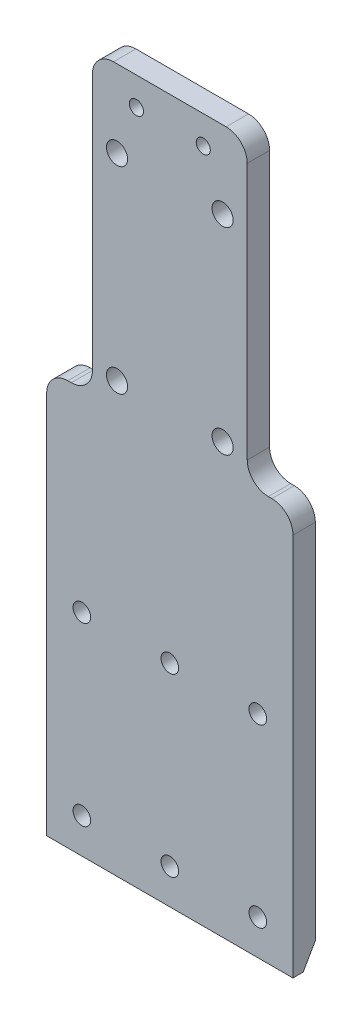
ISO-10303-21;
HEADER;
FILE_DESCRIPTION(('STEP AP214'),'2;1');
FILE_NAME('part.step','',(''),(''),'','','');
FILE_SCHEMA(('AUTOMOTIVE_DESIGN { 1 0 10303 214 1 1 1 1 }'));
ENDSEC;
DATA;
#1=APPLICATION_CONTEXT('core data for automotive mechanical design processes');
#2=APPLICATION_PROTOCOL_DEFINITION('international standard','automotive_design',2000,#1);
#3=PRODUCT_CONTEXT('',#1,'mechanical');
#4=PRODUCT('Part','Part','',(#3));
#5=PRODUCT_RELATED_PRODUCT_CATEGORY('part','',(#4));
#6=PRODUCT_DEFINITION_FORMATION('','',#4);
#7=PRODUCT_DEFINITION_CONTEXT('part definition',#1,'design');
#8=PRODUCT_DEFINITION('design','',#6,#7);
#9=PRODUCT_DEFINITION_SHAPE('','',#8);
#10=(LENGTH_UNIT() NAMED_UNIT(*) SI_UNIT(.MILLI.,.METRE.));
#11=(NAMED_UNIT(*) PLANE_ANGLE_UNIT() SI_UNIT($,.RADIAN.));
#12=(NAMED_UNIT(*) SI_UNIT($,.STERADIAN.) SOLID_ANGLE_UNIT());
#13=UNCERTAINTY_MEASURE_WITH_UNIT(LENGTH_MEASURE(1.E-05),#10,'distance_accuracy_value','');
#14=(GEOMETRIC_REPRESENTATION_CONTEXT(3) GLOBAL_UNCERTAINTY_ASSIGNED_CONTEXT((#13)) GLOBAL_UNIT_ASSIGNED_CONTEXT((#10,
#11,#12)) REPRESENTATION_CONTEXT('',''));
#15=CARTESIAN_POINT('',(0.,0.,0.));
#16=DIRECTION('',(0.,0.,1.));
#17=DIRECTION('',(1.,0.,0.));
#18=AXIS2_PLACEMENT_3D('',#15,#16,#17);
#19=CARTESIAN_POINT('',(-17.5,50.,3.175));
#20=DIRECTION('',(1.,0.,0.));
#21=DIRECTION('',(0.,1.,0.));
#22=AXIS2_PLACEMENT_3D('',#19,#20,#21);
#23=PLANE('',#22);
#24=DIRECTION('',(0.,-1.,0.));
#25=VECTOR('',#24,1.);
#26=CARTESIAN_POINT('',(-17.5,50.,0.));
#27=LINE('',#26,#25);
#28=CARTESIAN_POINT('',(-17.5,4.5,0.));
#29=VERTEX_POINT('',#28);
#30=CARTESIAN_POINT('',(-17.5,-47.,0.));
#31=VERTEX_POINT('',#30);
#32=EDGE_CURVE('E230',#29,#31,#27,.T.);
#33=ORIENTED_EDGE('',*,*,#32,.T.);
#34=DIRECTION('',(0.,0.86602540378444,-0.499999999999998));
#35=VECTOR('',#34,1.);
#36=CARTESIAN_POINT('',(-17.5,-50.,1.73205080756888));
#37=LINE('',#36,#35);
#38=CARTESIAN_POINT('',(-17.5,-50.,1.73205080756888));
#39=VERTEX_POINT('',#38);
#40=EDGE_CURVE('E11',#31,#39,#37,.F.);
#41=ORIENTED_EDGE('',*,*,#40,.T.);
#42=DIRECTION('',(0.,0.,-1.));
#43=VECTOR('',#42,1.);
#44=CARTESIAN_POINT('',(-17.5,-50.,3.175));
#45=LINE('',#44,#43);
#46=CARTESIAN_POINT('',(-17.5,-50.,3.175));
#47=VERTEX_POINT('',#46);
#48=EDGE_CURVE('E156',#47,#39,#45,.T.);
#49=ORIENTED_EDGE('',*,*,#48,.F.);
#50=DIRECTION('',(0.,-1.,0.));
#51=VECTOR('',#50,1.);
#52=CARTESIAN_POINT('',(-17.5,50.,3.175));
#53=LINE('',#52,#51);
#54=CARTESIAN_POINT('',(-17.5,4.5,3.175));
#55=VERTEX_POINT('',#54);
#56=EDGE_CURVE('E138',#55,#47,#53,.T.);
#57=ORIENTED_EDGE('',*,*,#56,.F.);
#58=DIRECTION('',(0.,0.,1.));
#59=VECTOR('',#58,1.);
#60=CARTESIAN_POINT('',(-17.5,4.5,3.175));
#61=LINE('',#60,#59);
#62=EDGE_CURVE('E204',#55,#29,#61,.F.);
#63=ORIENTED_EDGE('',*,*,#62,.T.);
#64=EDGE_LOOP('',(#33,#41,#49,#57,#63));
#65=FACE_BOUND('',#64,.T.);
#66=ADVANCED_FACE('F33',(#65),#23,.F.);
#67=CARTESIAN_POINT('',(-17.5,-50.,3.175));
#68=DIRECTION('',(0.,1.,0.));
#69=DIRECTION('',(0.,0.,1.));
#70=AXIS2_PLACEMENT_3D('',#67,#68,#69);
#71=PLANE('',#70);
#72=ORIENTED_EDGE('',*,*,#48,.T.);
#73=DIRECTION('',(1.,0.,0.));
#74=VECTOR('',#73,1.);
#75=CARTESIAN_POINT('',(-17.5,-50.,1.73205080756888));
#76=LINE('',#75,#74);
#77=CARTESIAN_POINT('',(17.5,-50.,1.73205080756888));
#78=VERTEX_POINT('',#77);
#79=EDGE_CURVE('E222',#39,#78,#76,.T.);
#80=ORIENTED_EDGE('',*,*,#79,.T.);
#81=DIRECTION('',(0.,0.,-1.));
#82=VECTOR('',#81,1.);
#83=CARTESIAN_POINT('',(17.5,-50.,3.175));
#84=LINE('',#83,#82);
#85=CARTESIAN_POINT('',(17.5,-50.,3.175));
#86=VERTEX_POINT('',#85);
#87=EDGE_CURVE('E158',#86,#78,#84,.T.);
#88=ORIENTED_EDGE('',*,*,#87,.F.);
#89=DIRECTION('',(1.,0.,0.));
#90=VECTOR('',#89,1.);
#91=CARTESIAN_POINT('',(-17.5,-50.,3.175));
#92=LINE('',#91,#90);
#93=EDGE_CURVE('E143',#47,#86,#92,.T.);
#94=ORIENTED_EDGE('',*,*,#93,.F.);
#95=EDGE_LOOP('',(#72,#80,#88,#94));
#96=FACE_BOUND('',#95,.T.);
#97=ADVANCED_FACE('F154',(#96),#71,.F.);
#98=CARTESIAN_POINT('',(17.5,50.,3.175));
#99=DIRECTION('',(-1.,0.,0.));
#100=DIRECTION('',(0.,-1.,0.));
#101=AXIS2_PLACEMENT_3D('',#98,#99,#100);
#102=PLANE('',#101);
#103=ORIENTED_EDGE('',*,*,#87,.T.);
#104=DIRECTION('',(0.,-0.86602540378444,0.499999999999998));
#105=VECTOR('',#104,1.);
#106=CARTESIAN_POINT('',(17.5,-50.,1.73205080756888));
#107=LINE('',#106,#105);
#108=CARTESIAN_POINT('',(17.5,-47.,0.));
#109=VERTEX_POINT('',#108);
#110=EDGE_CURVE('E55',#78,#109,#107,.F.);
#111=ORIENTED_EDGE('',*,*,#110,.T.);
#112=DIRECTION('',(0.,1.,0.));
#113=VECTOR('',#112,1.);
#114=CARTESIAN_POINT('',(17.5,50.,0.));
#115=LINE('',#114,#113);
#116=CARTESIAN_POINT('',(17.5,4.5,0.));
#117=VERTEX_POINT('',#116);
#118=EDGE_CURVE('E232',#109,#117,#115,.T.);
#119=ORIENTED_EDGE('',*,*,#118,.T.);
#120=DIRECTION('',(0.,0.,1.));
#121=VECTOR('',#120,1.);
#122=CARTESIAN_POINT('',(17.5,4.5,3.175));
#123=LINE('',#122,#121);
#124=CARTESIAN_POINT('',(17.5,4.5,3.175));
#125=VERTEX_POINT('',#124);
#126=EDGE_CURVE('E206',#117,#125,#123,.T.);
#127=ORIENTED_EDGE('',*,*,#126,.T.);
#128=DIRECTION('',(0.,1.,0.));
#129=VECTOR('',#128,1.);
#130=CARTESIAN_POINT('',(17.5,50.,3.175));
#131=LINE('',#130,#129);
#132=EDGE_CURVE('E160',#86,#125,#131,.T.);
#133=ORIENTED_EDGE('',*,*,#132,.F.);
#134=EDGE_LOOP('',(#103,#111,#119,#127,#133));
#135=FACE_BOUND('',#134,.T.);
#136=ADVANCED_FACE('F225',(#135),#102,.F.);
#137=CARTESIAN_POINT('',(-17.5,50.,3.175));
#138=DIRECTION('',(0.,-1.,0.));
#139=DIRECTION('',(0.,0.,-1.));
#140=AXIS2_PLACEMENT_3D('',#137,#138,#139);
#141=PLANE('',#140);
#142=DIRECTION('',(-1.,0.,0.));
#143=VECTOR('',#142,1.);
#144=CARTESIAN_POINT('',(-17.5,50.,0.));
#145=LINE('',#144,#143);
#146=CARTESIAN_POINT('',(8.,50.,0.));
#147=VERTEX_POINT('',#146);
#148=CARTESIAN_POINT('',(-8.,50.,0.));
#149=VERTEX_POINT('',#148);
#150=EDGE_CURVE('E150',#147,#149,#145,.T.);
#151=ORIENTED_EDGE('',*,*,#150,.T.);
#152=DIRECTION('',(0.,0.,1.));
#153=VECTOR('',#152,1.);
#154=CARTESIAN_POINT('',(-8.,50.,3.175));
#155=LINE('',#154,#153);
#156=CARTESIAN_POINT('',(-8.,50.,3.175));
#157=VERTEX_POINT('',#156);
#158=EDGE_CURVE('E165',#149,#157,#155,.T.);
#159=ORIENTED_EDGE('',*,*,#158,.T.);
#160=DIRECTION('',(-1.,0.,0.));
#161=VECTOR('',#160,1.);
#162=CARTESIAN_POINT('',(-17.5,50.,3.175));
#163=LINE('',#162,#161);
#164=CARTESIAN_POINT('',(8.,50.,3.175));
#165=VERTEX_POINT('',#164);
#166=EDGE_CURVE('E167',#165,#157,#163,.T.);
#167=ORIENTED_EDGE('',*,*,#166,.F.);
#168=DIRECTION('',(0.,0.,1.));
#169=VECTOR('',#168,1.);
#170=CARTESIAN_POINT('',(8.,50.,3.175));
#171=LINE('',#170,#169);
#172=EDGE_CURVE('E163',#165,#147,#171,.F.);
#173=ORIENTED_EDGE('',*,*,#172,.T.);
#174=EDGE_LOOP('',(#151,#159,#167,#173));
#175=FACE_BOUND('',#174,.T.);
#176=ADVANCED_FACE('F238',(#175),#141,.F.);
#177=CARTESIAN_POINT('',(0.,0.,3.175));
#178=DIRECTION('',(0.,0.,1.));
#179=DIRECTION('',(1.,0.,0.));
#180=AXIS2_PLACEMENT_3D('',#177,#178,#179);
#181=PLANE('',#180);
#182=CARTESIAN_POINT('',(0.,-20.,3.175));
#183=DIRECTION('',(0.,0.,1.));
#184=DIRECTION('',(1.,0.,0.));
#185=AXIS2_PLACEMENT_3D('',#182,#183,#184);
#186=CIRCLE('',#185,1.25);
#187=CARTESIAN_POINT('',(1.25,-20.,3.175));
#188=VERTEX_POINT('',#187);
#189=EDGE_CURVE('E330',#188,#188,#186,.T.);
#190=ORIENTED_EDGE('',*,*,#189,.F.);
#191=EDGE_LOOP('',(#190));
#192=FACE_BOUND('',#191,.T.);
#193=CARTESIAN_POINT('',(0.,-45.,3.175));
#194=DIRECTION('',(0.,0.,1.));
#195=DIRECTION('',(1.,0.,0.));
#196=AXIS2_PLACEMENT_3D('',#193,#194,#195);
#197=CIRCLE('',#196,1.25);
#198=CARTESIAN_POINT('',(1.25,-45.,3.175));
#199=VERTEX_POINT('',#198);
#200=EDGE_CURVE('E336',#199,#199,#197,.T.);
#201=ORIENTED_EDGE('',*,*,#200,.F.);
#202=EDGE_LOOP('',(#201));
#203=FACE_BOUND('',#202,.T.);
#204=CARTESIAN_POINT('',(12.5,-20.,3.175));
#205=DIRECTION('',(0.,0.,1.));
#206=DIRECTION('',(1.,0.,0.));
#207=AXIS2_PLACEMENT_3D('',#204,#205,#206);
#208=CIRCLE('',#207,1.25);
#209=CARTESIAN_POINT('',(13.75,-20.,3.175));
#210=VERTEX_POINT('',#209);
#211=EDGE_CURVE('E342',#210,#210,#208,.T.);
#212=ORIENTED_EDGE('',*,*,#211,.F.);
#213=EDGE_LOOP('',(#212));
#214=FACE_BOUND('',#213,.T.);
#215=CARTESIAN_POINT('',(-12.5,-20.,3.175));
#216=DIRECTION('',(0.,0.,1.));
#217=DIRECTION('',(1.,0.,0.));
#218=AXIS2_PLACEMENT_3D('',#215,#216,#217);
#219=CIRCLE('',#218,1.25);
#220=CARTESIAN_POINT('',(-11.25,-20.,3.175));
#221=VERTEX_POINT('',#220);
#222=EDGE_CURVE('E318',#221,#221,#219,.T.);
#223=ORIENTED_EDGE('',*,*,#222,.F.);
#224=EDGE_LOOP('',(#223));
#225=FACE_BOUND('',#224,.T.);
#226=CARTESIAN_POINT('',(12.5,-45.,3.175));
#227=DIRECTION('',(0.,0.,1.));
#228=DIRECTION('',(1.,0.,0.));
#229=AXIS2_PLACEMENT_3D('',#226,#227,#228);
#230=CIRCLE('',#229,1.25);
#231=CARTESIAN_POINT('',(13.75,-45.,3.175));
#232=VERTEX_POINT('',#231);
#233=EDGE_CURVE('E325',#232,#232,#230,.T.);
#234=ORIENTED_EDGE('',*,*,#233,.F.);
#235=EDGE_LOOP('',(#234));
#236=FACE_BOUND('',#235,.T.);
#237=CARTESIAN_POINT('',(-12.5,-45.,3.175));
#238=DIRECTION('',(0.,0.,1.));
#239=DIRECTION('',(1.,0.,0.));
#240=AXIS2_PLACEMENT_3D('',#237,#238,#239);
#241=CIRCLE('',#240,1.25);
#242=CARTESIAN_POINT('',(-11.25,-45.,3.175));
#243=VERTEX_POINT('',#242);
#244=EDGE_CURVE('E312',#243,#243,#241,.T.);
#245=ORIENTED_EDGE('',*,*,#244,.F.);
#246=EDGE_LOOP('',(#245));
#247=FACE_BOUND('',#246,.T.);
#248=CARTESIAN_POINT('',(-4.75,46.,3.175));
#249=DIRECTION('',(0.,0.,1.));
#250=DIRECTION('',(1.,0.,0.));
#251=AXIS2_PLACEMENT_3D('',#248,#249,#250);
#252=CIRCLE('',#251,1.);
#253=CARTESIAN_POINT('',(-3.75,46.,3.175));
#254=VERTEX_POINT('',#253);
#255=EDGE_CURVE('E306',#254,#254,#252,.T.);
#256=ORIENTED_EDGE('',*,*,#255,.F.);
#257=EDGE_LOOP('',(#256));
#258=FACE_BOUND('',#257,.T.);
#259=CARTESIAN_POINT('',(4.75,46.,3.175));
#260=DIRECTION('',(0.,0.,1.));
#261=DIRECTION('',(1.,0.,0.));
#262=AXIS2_PLACEMENT_3D('',#259,#260,#261);
#263=CIRCLE('',#262,1.);
#264=CARTESIAN_POINT('',(5.75,46.,3.175));
#265=VERTEX_POINT('',#264);
#266=EDGE_CURVE('E300',#265,#265,#263,.T.);
#267=ORIENTED_EDGE('',*,*,#266,.F.);
#268=EDGE_LOOP('',(#267));
#269=FACE_BOUND('',#268,.T.);
#270=CARTESIAN_POINT('',(7.5,39.,3.175));
#271=DIRECTION('',(0.,0.,1.));
#272=DIRECTION('',(-1.,0.,0.));
#273=AXIS2_PLACEMENT_3D('',#270,#271,#272);
#274=CIRCLE('',#273,1.5);
#275=CARTESIAN_POINT('',(6.,39.,3.175));
#276=VERTEX_POINT('',#275);
#277=EDGE_CURVE('E282',#276,#276,#274,.T.);
#278=ORIENTED_EDGE('',*,*,#277,.F.);
#279=EDGE_LOOP('',(#278));
#280=FACE_BOUND('',#279,.T.);
#281=CARTESIAN_POINT('',(7.5,11.,3.175));
#282=DIRECTION('',(0.,0.,1.));
#283=DIRECTION('',(-1.,0.,0.));
#284=AXIS2_PLACEMENT_3D('',#281,#282,#283);
#285=CIRCLE('',#284,1.5);
#286=CARTESIAN_POINT('',(6.,11.,3.175));
#287=VERTEX_POINT('',#286);
#288=EDGE_CURVE('E289',#287,#287,#285,.T.);
#289=ORIENTED_EDGE('',*,*,#288,.F.);
#290=EDGE_LOOP('',(#289));
#291=FACE_BOUND('',#290,.T.);
#292=CARTESIAN_POINT('',(-7.5,11.,3.175));
#293=DIRECTION('',(0.,0.,1.));
#294=DIRECTION('',(1.,0.,0.));
#295=AXIS2_PLACEMENT_3D('',#292,#293,#294);
#296=CIRCLE('',#295,1.5);
#297=CARTESIAN_POINT('',(-6.,11.,3.175));
#298=VERTEX_POINT('',#297);
#299=EDGE_CURVE('E295',#298,#298,#296,.T.);
#300=ORIENTED_EDGE('',*,*,#299,.F.);
#301=EDGE_LOOP('',(#300));
#302=FACE_BOUND('',#301,.T.);
#303=CARTESIAN_POINT('',(-7.5,39.,3.175));
#304=DIRECTION('',(0.,0.,1.));
#305=DIRECTION('',(1.,0.,0.));
#306=AXIS2_PLACEMENT_3D('',#303,#304,#305);
#307=CIRCLE('',#306,1.5);
#308=CARTESIAN_POINT('',(-6.,39.,3.175));
#309=VERTEX_POINT('',#308);
#310=EDGE_CURVE('E264',#309,#309,#307,.T.);
#311=ORIENTED_EDGE('',*,*,#310,.F.);
#312=EDGE_LOOP('',(#311));
#313=FACE_BOUND('',#312,.T.);
#314=ORIENTED_EDGE('',*,*,#166,.T.);
#315=CARTESIAN_POINT('',(-8.,47.,3.175));
#316=DIRECTION('',(0.,0.,1.));
#317=DIRECTION('',(1.,0.,0.));
#318=AXIS2_PLACEMENT_3D('',#315,#316,#317);
#319=CIRCLE('',#318,3.);
#320=CARTESIAN_POINT('',(-11.,47.,3.175));
#321=VERTEX_POINT('',#320);
#322=EDGE_CURVE('E178',#157,#321,#319,.T.);
#323=ORIENTED_EDGE('',*,*,#322,.T.);
#324=DIRECTION('',(0.,1.,0.));
#325=VECTOR('',#324,1.);
#326=CARTESIAN_POINT('',(-11.,50.,3.175));
#327=LINE('',#326,#325);
#328=CARTESIAN_POINT('',(-11.,10.5,3.175));
#329=VERTEX_POINT('',#328);
#330=EDGE_CURVE('E248',#329,#321,#327,.T.);
#331=ORIENTED_EDGE('',*,*,#330,.F.);
#332=CARTESIAN_POINT('',(-14.,10.5,3.175));
#333=DIRECTION('',(0.,0.,1.));
#334=DIRECTION('',(1.,0.,0.));
#335=AXIS2_PLACEMENT_3D('',#332,#333,#334);
#336=CIRCLE('',#335,3.);
#337=CARTESIAN_POINT('',(-14.,7.5,3.175));
#338=VERTEX_POINT('',#337);
#339=EDGE_CURVE('E214',#329,#338,#336,.F.);
#340=ORIENTED_EDGE('',*,*,#339,.T.);
#341=DIRECTION('',(1.,0.,0.));
#342=VECTOR('',#341,1.);
#343=CARTESIAN_POINT('',(-17.5,7.5,3.175));
#344=LINE('',#343,#342);
#345=CARTESIAN_POINT('',(-14.5,7.5,3.175));
#346=VERTEX_POINT('',#345);
#347=EDGE_CURVE('E255',#346,#338,#344,.T.);
#348=ORIENTED_EDGE('',*,*,#347,.F.);
#349=CARTESIAN_POINT('',(-14.5,4.5,3.175));
#350=DIRECTION('',(0.,0.,1.));
#351=DIRECTION('',(1.,0.,0.));
#352=AXIS2_PLACEMENT_3D('',#349,#350,#351);
#353=CIRCLE('',#352,3.);
#354=EDGE_CURVE('E146',#346,#55,#353,.T.);
#355=ORIENTED_EDGE('',*,*,#354,.T.);
#356=ORIENTED_EDGE('',*,*,#56,.T.);
#357=ORIENTED_EDGE('',*,*,#93,.T.);
#358=ORIENTED_EDGE('',*,*,#132,.T.);
#359=CARTESIAN_POINT('',(14.5,4.5,3.175));
#360=DIRECTION('',(0.,0.,1.));
#361=DIRECTION('',(1.,0.,0.));
#362=AXIS2_PLACEMENT_3D('',#359,#360,#361);
#363=CIRCLE('',#362,3.);
#364=CARTESIAN_POINT('',(14.5,7.5,3.175));
#365=VERTEX_POINT('',#364);
#366=EDGE_CURVE('E173',#125,#365,#363,.T.);
#367=ORIENTED_EDGE('',*,*,#366,.T.);
#368=DIRECTION('',(1.,0.,0.));
#369=VECTOR('',#368,1.);
#370=CARTESIAN_POINT('',(11.,7.5,3.175));
#371=LINE('',#370,#369);
#372=CARTESIAN_POINT('',(14.,7.5,3.175));
#373=VERTEX_POINT('',#372);
#374=EDGE_CURVE('E272',#373,#365,#371,.T.);
#375=ORIENTED_EDGE('',*,*,#374,.F.);
#376=CARTESIAN_POINT('',(14.,10.5,3.175));
#377=DIRECTION('',(0.,0.,1.));
#378=DIRECTION('',(1.,0.,0.));
#379=AXIS2_PLACEMENT_3D('',#376,#377,#378);
#380=CIRCLE('',#379,3.);
#381=CARTESIAN_POINT('',(11.,10.5,3.175));
#382=VERTEX_POINT('',#381);
#383=EDGE_CURVE('E218',#373,#382,#380,.F.);
#384=ORIENTED_EDGE('',*,*,#383,.T.);
#385=DIRECTION('',(0.,-1.,0.));
#386=VECTOR('',#385,1.);
#387=CARTESIAN_POINT('',(11.,7.5,3.175));
#388=LINE('',#387,#386);
#389=CARTESIAN_POINT('',(11.,47.,3.175));
#390=VERTEX_POINT('',#389);
#391=EDGE_CURVE('E271',#390,#382,#388,.T.);
#392=ORIENTED_EDGE('',*,*,#391,.F.);
#393=CARTESIAN_POINT('',(8.00000000000001,47.,3.175));
#394=DIRECTION('',(0.,0.,1.));
#395=DIRECTION('',(1.,0.,0.));
#396=AXIS2_PLACEMENT_3D('',#393,#394,#395);
#397=CIRCLE('',#396,3.);
#398=EDGE_CURVE('E176',#390,#165,#397,.T.);
#399=ORIENTED_EDGE('',*,*,#398,.T.);
#400=EDGE_LOOP('',(#314,#323,#331,#340,#348,#355,#356,#357,#358,#367,#375,#384,#392,#399));
#401=FACE_BOUND('',#400,.T.);
#402=ADVANCED_FACE('F141',(#192,#203,#214,#225,#236,#247,#258,#269,#280,#291,#302,#313,#401),
#181,.T.);
#403=CARTESIAN_POINT('',(0.,0.,0.));
#404=DIRECTION('',(0.,0.,1.));
#405=DIRECTION('',(1.,0.,0.));
#406=AXIS2_PLACEMENT_3D('',#403,#404,#405);
#407=PLANE('',#406);
#408=CARTESIAN_POINT('',(0.,-20.,0.));
#409=DIRECTION('',(0.,0.,1.));
#410=DIRECTION('',(1.,0.,0.));
#411=AXIS2_PLACEMENT_3D('',#408,#409,#410);
#412=CIRCLE('',#411,1.25);
#413=CARTESIAN_POINT('',(1.25,-20.,0.));
#414=VERTEX_POINT('',#413);
#415=EDGE_CURVE('E333',#414,#414,#412,.T.);
#416=ORIENTED_EDGE('',*,*,#415,.T.);
#417=EDGE_LOOP('',(#416));
#418=FACE_BOUND('',#417,.T.);
#419=CARTESIAN_POINT('',(0.,-45.,0.));
#420=DIRECTION('',(0.,0.,1.));
#421=DIRECTION('',(1.,0.,0.));
#422=AXIS2_PLACEMENT_3D('',#419,#420,#421);
#423=CIRCLE('',#422,1.25);
#424=CARTESIAN_POINT('',(1.25,-45.,0.));
#425=VERTEX_POINT('',#424);
#426=EDGE_CURVE('E339',#425,#425,#423,.T.);
#427=ORIENTED_EDGE('',*,*,#426,.T.);
#428=EDGE_LOOP('',(#427));
#429=FACE_BOUND('',#428,.T.);
#430=CARTESIAN_POINT('',(12.5,-20.,0.));
#431=DIRECTION('',(0.,0.,1.));
#432=DIRECTION('',(1.,0.,0.));
#433=AXIS2_PLACEMENT_3D('',#430,#431,#432);
#434=CIRCLE('',#433,1.25);
#435=CARTESIAN_POINT('',(13.75,-20.,0.));
#436=VERTEX_POINT('',#435);
#437=EDGE_CURVE('E322',#436,#436,#434,.T.);
#438=ORIENTED_EDGE('',*,*,#437,.T.);
#439=EDGE_LOOP('',(#438));
#440=FACE_BOUND('',#439,.T.);
#441=CARTESIAN_POINT('',(-12.5,-20.,0.));
#442=DIRECTION('',(0.,0.,1.));
#443=DIRECTION('',(1.,0.,0.));
#444=AXIS2_PLACEMENT_3D('',#441,#442,#443);
#445=CIRCLE('',#444,1.25);
#446=CARTESIAN_POINT('',(-11.25,-20.,0.));
#447=VERTEX_POINT('',#446);
#448=EDGE_CURVE('E321',#447,#447,#445,.T.);
#449=ORIENTED_EDGE('',*,*,#448,.T.);
#450=EDGE_LOOP('',(#449));
#451=FACE_BOUND('',#450,.T.);
#452=CARTESIAN_POINT('',(12.5,-45.,0.));
#453=DIRECTION('',(0.,0.,1.));
#454=DIRECTION('',(1.,0.,0.));
#455=AXIS2_PLACEMENT_3D('',#452,#453,#454);
#456=CIRCLE('',#455,1.25);
#457=CARTESIAN_POINT('',(13.75,-45.,0.));
#458=VERTEX_POINT('',#457);
#459=EDGE_CURVE('E315',#458,#458,#456,.T.);
#460=ORIENTED_EDGE('',*,*,#459,.T.);
#461=EDGE_LOOP('',(#460));
#462=FACE_BOUND('',#461,.T.);
#463=CARTESIAN_POINT('',(-12.5,-45.,0.));
#464=DIRECTION('',(0.,0.,1.));
#465=DIRECTION('',(1.,0.,0.));
#466=AXIS2_PLACEMENT_3D('',#463,#464,#465);
#467=CIRCLE('',#466,1.25);
#468=CARTESIAN_POINT('',(-11.25,-45.,0.));
#469=VERTEX_POINT('',#468);
#470=EDGE_CURVE('E309',#469,#469,#467,.T.);
#471=ORIENTED_EDGE('',*,*,#470,.T.);
#472=EDGE_LOOP('',(#471));
#473=FACE_BOUND('',#472,.T.);
#474=CARTESIAN_POINT('',(-4.75,46.,0.));
#475=DIRECTION('',(0.,0.,1.));
#476=DIRECTION('',(1.,0.,0.));
#477=AXIS2_PLACEMENT_3D('',#474,#475,#476);
#478=CIRCLE('',#477,1.);
#479=CARTESIAN_POINT('',(-3.75,46.,0.));
#480=VERTEX_POINT('',#479);
#481=EDGE_CURVE('E303',#480,#480,#478,.T.);
#482=ORIENTED_EDGE('',*,*,#481,.T.);
#483=EDGE_LOOP('',(#482));
#484=FACE_BOUND('',#483,.T.);
#485=CARTESIAN_POINT('',(4.75,46.,0.));
#486=DIRECTION('',(0.,0.,1.));
#487=DIRECTION('',(1.,0.,0.));
#488=AXIS2_PLACEMENT_3D('',#485,#486,#487);
#489=CIRCLE('',#488,1.);
#490=CARTESIAN_POINT('',(5.75,46.,0.));
#491=VERTEX_POINT('',#490);
#492=EDGE_CURVE('E286',#491,#491,#489,.T.);
#493=ORIENTED_EDGE('',*,*,#492,.T.);
#494=EDGE_LOOP('',(#493));
#495=FACE_BOUND('',#494,.T.);
#496=CARTESIAN_POINT('',(7.5,39.,0.));
#497=DIRECTION('',(0.,0.,1.));
#498=DIRECTION('',(-1.,0.,0.));
#499=AXIS2_PLACEMENT_3D('',#496,#497,#498);
#500=CIRCLE('',#499,1.5);
#501=CARTESIAN_POINT('',(6.,39.,0.));
#502=VERTEX_POINT('',#501);
#503=EDGE_CURVE('E285',#502,#502,#500,.T.);
#504=ORIENTED_EDGE('',*,*,#503,.T.);
#505=EDGE_LOOP('',(#504));
#506=FACE_BOUND('',#505,.T.);
#507=CARTESIAN_POINT('',(7.5,11.,0.));
#508=DIRECTION('',(0.,0.,1.));
#509=DIRECTION('',(-1.,0.,0.));
#510=AXIS2_PLACEMENT_3D('',#507,#508,#509);
#511=CIRCLE('',#510,1.5);
#512=CARTESIAN_POINT('',(6.,11.,0.));
#513=VERTEX_POINT('',#512);
#514=EDGE_CURVE('E292',#513,#513,#511,.T.);
#515=ORIENTED_EDGE('',*,*,#514,.T.);
#516=EDGE_LOOP('',(#515));
#517=FACE_BOUND('',#516,.T.);
#518=CARTESIAN_POINT('',(-7.5,11.,0.));
#519=DIRECTION('',(0.,0.,1.));
#520=DIRECTION('',(1.,0.,0.));
#521=AXIS2_PLACEMENT_3D('',#518,#519,#520);
#522=CIRCLE('',#521,1.5);
#523=CARTESIAN_POINT('',(-6.,11.,0.));
#524=VERTEX_POINT('',#523);
#525=EDGE_CURVE('E268',#524,#524,#522,.T.);
#526=ORIENTED_EDGE('',*,*,#525,.T.);
#527=EDGE_LOOP('',(#526));
#528=FACE_BOUND('',#527,.T.);
#529=CARTESIAN_POINT('',(-7.5,39.,0.));
#530=DIRECTION('',(0.,0.,1.));
#531=DIRECTION('',(1.,0.,0.));
#532=AXIS2_PLACEMENT_3D('',#529,#530,#531);
#533=CIRCLE('',#532,1.5);
#534=CARTESIAN_POINT('',(-6.,39.,0.));
#535=VERTEX_POINT('',#534);
#536=EDGE_CURVE('E267',#535,#535,#533,.T.);
#537=ORIENTED_EDGE('',*,*,#536,.T.);
#538=EDGE_LOOP('',(#537));
#539=FACE_BOUND('',#538,.T.);
#540=ORIENTED_EDGE('',*,*,#118,.F.);
#541=DIRECTION('',(-1.,0.,0.));
#542=VECTOR('',#541,1.);
#543=CARTESIAN_POINT('',(0.,-47.,0.));
#544=LINE('',#543,#542);
#545=EDGE_CURVE('E41',#109,#31,#544,.T.);
#546=ORIENTED_EDGE('',*,*,#545,.T.);
#547=ORIENTED_EDGE('',*,*,#32,.F.);
#548=CARTESIAN_POINT('',(-14.5,4.5,0.));
#549=DIRECTION('',(0.,0.,1.));
#550=DIRECTION('',(1.,0.,0.));
#551=AXIS2_PLACEMENT_3D('',#548,#549,#550);
#552=CIRCLE('',#551,3.);
#553=CARTESIAN_POINT('',(-14.5,7.5,0.));
#554=VERTEX_POINT('',#553);
#555=EDGE_CURVE('E188',#29,#554,#552,.F.);
#556=ORIENTED_EDGE('',*,*,#555,.T.);
#557=DIRECTION('',(1.,0.,0.));
#558=VECTOR('',#557,1.);
#559=CARTESIAN_POINT('',(-17.5,7.5,0.));
#560=LINE('',#559,#558);
#561=CARTESIAN_POINT('',(-14.,7.5,0.));
#562=VERTEX_POINT('',#561);
#563=EDGE_CURVE('E254',#554,#562,#560,.T.);
#564=ORIENTED_EDGE('',*,*,#563,.T.);
#565=CARTESIAN_POINT('',(-14.,10.5,0.));
#566=DIRECTION('',(0.,0.,1.));
#567=DIRECTION('',(1.,0.,0.));
#568=AXIS2_PLACEMENT_3D('',#565,#566,#567);
#569=CIRCLE('',#568,3.);
#570=CARTESIAN_POINT('',(-11.,10.5,0.));
#571=VERTEX_POINT('',#570);
#572=EDGE_CURVE('E216',#562,#571,#569,.T.);
#573=ORIENTED_EDGE('',*,*,#572,.T.);
#574=DIRECTION('',(0.,1.,0.));
#575=VECTOR('',#574,1.);
#576=CARTESIAN_POINT('',(-11.,50.,0.));
#577=LINE('',#576,#575);
#578=CARTESIAN_POINT('',(-11.,47.,0.));
#579=VERTEX_POINT('',#578);
#580=EDGE_CURVE('E233',#571,#579,#577,.T.);
#581=ORIENTED_EDGE('',*,*,#580,.T.);
#582=CARTESIAN_POINT('',(-8.,47.,0.));
#583=DIRECTION('',(0.,0.,1.));
#584=DIRECTION('',(1.,0.,0.));
#585=AXIS2_PLACEMENT_3D('',#582,#583,#584);
#586=CIRCLE('',#585,3.);
#587=EDGE_CURVE('E192',#579,#149,#586,.F.);
#588=ORIENTED_EDGE('',*,*,#587,.T.);
#589=ORIENTED_EDGE('',*,*,#150,.F.);
#590=CARTESIAN_POINT('',(8.00000000000001,47.,0.));
#591=DIRECTION('',(0.,0.,1.));
#592=DIRECTION('',(1.,0.,0.));
#593=AXIS2_PLACEMENT_3D('',#590,#591,#592);
#594=CIRCLE('',#593,3.);
#595=CARTESIAN_POINT('',(11.,47.,0.));
#596=VERTEX_POINT('',#595);
#597=EDGE_CURVE('E190',#147,#596,#594,.F.);
#598=ORIENTED_EDGE('',*,*,#597,.T.);
#599=DIRECTION('',(0.,-1.,0.));
#600=VECTOR('',#599,1.);
#601=CARTESIAN_POINT('',(11.,7.5,0.));
#602=LINE('',#601,#600);
#603=CARTESIAN_POINT('',(11.,10.5,0.));
#604=VERTEX_POINT('',#603);
#605=EDGE_CURVE('E275',#596,#604,#602,.T.);
#606=ORIENTED_EDGE('',*,*,#605,.T.);
#607=CARTESIAN_POINT('',(14.,10.5,0.));
#608=DIRECTION('',(0.,0.,1.));
#609=DIRECTION('',(1.,0.,0.));
#610=AXIS2_PLACEMENT_3D('',#607,#608,#609);
#611=CIRCLE('',#610,3.);
#612=CARTESIAN_POINT('',(14.,7.5,0.));
#613=VERTEX_POINT('',#612);
#614=EDGE_CURVE('E220',#604,#613,#611,.T.);
#615=ORIENTED_EDGE('',*,*,#614,.T.);
#616=DIRECTION('',(1.,0.,0.));
#617=VECTOR('',#616,1.);
#618=CARTESIAN_POINT('',(11.,7.5,0.));
#619=LINE('',#618,#617);
#620=CARTESIAN_POINT('',(14.5,7.5,0.));
#621=VERTEX_POINT('',#620);
#622=EDGE_CURVE('E260',#613,#621,#619,.T.);
#623=ORIENTED_EDGE('',*,*,#622,.T.);
#624=CARTESIAN_POINT('',(14.5,4.5,0.));
#625=DIRECTION('',(0.,0.,1.));
#626=DIRECTION('',(1.,0.,0.));
#627=AXIS2_PLACEMENT_3D('',#624,#625,#626);
#628=CIRCLE('',#627,3.);
#629=EDGE_CURVE('E185',#621,#117,#628,.F.);
#630=ORIENTED_EDGE('',*,*,#629,.T.);
#631=EDGE_LOOP('',(#540,#546,#547,#556,#564,#573,#581,#588,#589,#598,#606,#615,#623,#630));
#632=FACE_BOUND('',#631,.T.);
#633=ADVANCED_FACE('F348',(#418,#429,#440,#451,#462,#473,#484,#495,#506,#517,#528,#539,#632),
#407,.F.);
#634=CARTESIAN_POINT('',(-11.,50.,0.));
#635=DIRECTION('',(1.,0.,0.));
#636=DIRECTION('',(0.,1.,0.));
#637=AXIS2_PLACEMENT_3D('',#634,#635,#636);
#638=PLANE('',#637);
#639=ORIENTED_EDGE('',*,*,#330,.T.);
#640=DIRECTION('',(0.,0.,1.));
#641=VECTOR('',#640,1.);
#642=CARTESIAN_POINT('',(-11.,47.,0.));
#643=LINE('',#642,#641);
#644=EDGE_CURVE('E183',#321,#579,#643,.F.);
#645=ORIENTED_EDGE('',*,*,#644,.T.);
#646=ORIENTED_EDGE('',*,*,#580,.F.);
#647=DIRECTION('',(0.,0.,1.));
#648=VECTOR('',#647,1.);
#649=CARTESIAN_POINT('',(-11.,10.5,3.175));
#650=LINE('',#649,#648);
#651=EDGE_CURVE('E180',#571,#329,#650,.T.);
#652=ORIENTED_EDGE('',*,*,#651,.T.);
#653=EDGE_LOOP('',(#639,#645,#646,#652));
#654=FACE_BOUND('',#653,.T.);
#655=ADVANCED_FACE('F250',(#654),#638,.F.);
#656=CARTESIAN_POINT('',(-17.5,7.5,0.));
#657=DIRECTION('',(0.,-1.,0.));
#658=DIRECTION('',(0.,0.,-1.));
#659=AXIS2_PLACEMENT_3D('',#656,#657,#658);
#660=PLANE('',#659);
#661=ORIENTED_EDGE('',*,*,#563,.F.);
#662=DIRECTION('',(0.,0.,1.));
#663=VECTOR('',#662,1.);
#664=CARTESIAN_POINT('',(-14.5,7.5,0.));
#665=LINE('',#664,#663);
#666=EDGE_CURVE('E201',#554,#346,#665,.T.);
#667=ORIENTED_EDGE('',*,*,#666,.T.);
#668=ORIENTED_EDGE('',*,*,#347,.T.);
#669=DIRECTION('',(0.,0.,1.));
#670=VECTOR('',#669,1.);
#671=CARTESIAN_POINT('',(-14.,7.5,0.));
#672=LINE('',#671,#670);
#673=EDGE_CURVE('E199',#338,#562,#672,.F.);
#674=ORIENTED_EDGE('',*,*,#673,.T.);
#675=EDGE_LOOP('',(#661,#667,#668,#674));
#676=FACE_BOUND('',#675,.T.);
#677=ADVANCED_FACE('F445',(#676),#660,.F.);
#678=CARTESIAN_POINT('',(11.,7.5,0.));
#679=DIRECTION('',(-1.,0.,0.));
#680=DIRECTION('',(0.,-1.,0.));
#681=AXIS2_PLACEMENT_3D('',#678,#679,#680);
#682=PLANE('',#681);
#683=ORIENTED_EDGE('',*,*,#605,.F.);
#684=DIRECTION('',(0.,0.,1.));
#685=VECTOR('',#684,1.);
#686=CARTESIAN_POINT('',(11.,47.,0.));
#687=LINE('',#686,#685);
#688=EDGE_CURVE('E196',#596,#390,#687,.T.);
#689=ORIENTED_EDGE('',*,*,#688,.T.);
#690=ORIENTED_EDGE('',*,*,#391,.T.);
#691=DIRECTION('',(0.,0.,1.));
#692=VECTOR('',#691,1.);
#693=CARTESIAN_POINT('',(11.,10.5,0.));
#694=LINE('',#693,#692);
#695=EDGE_CURVE('E194',#382,#604,#694,.F.);
#696=ORIENTED_EDGE('',*,*,#695,.T.);
#697=EDGE_LOOP('',(#683,#689,#690,#696));
#698=FACE_BOUND('',#697,.T.);
#699=ADVANCED_FACE('F394',(#698),#682,.F.);
#700=CARTESIAN_POINT('',(11.,7.5,0.));
#701=DIRECTION('',(0.,-1.,0.));
#702=DIRECTION('',(0.,0.,-1.));
#703=AXIS2_PLACEMENT_3D('',#700,#701,#702);
#704=PLANE('',#703);
#705=ORIENTED_EDGE('',*,*,#374,.T.);
#706=DIRECTION('',(0.,0.,1.));
#707=VECTOR('',#706,1.);
#708=CARTESIAN_POINT('',(14.5,7.5,0.));
#709=LINE('',#708,#707);
#710=EDGE_CURVE('E212',#365,#621,#709,.F.);
#711=ORIENTED_EDGE('',*,*,#710,.T.);
#712=ORIENTED_EDGE('',*,*,#622,.F.);
#713=DIRECTION('',(0.,0.,1.));
#714=VECTOR('',#713,1.);
#715=CARTESIAN_POINT('',(14.,7.5,3.175));
#716=LINE('',#715,#714);
#717=EDGE_CURVE('E209',#613,#373,#716,.T.);
#718=ORIENTED_EDGE('',*,*,#717,.T.);
#719=EDGE_LOOP('',(#705,#711,#712,#718));
#720=FACE_BOUND('',#719,.T.);
#721=ADVANCED_FACE('F384',(#720),#704,.F.);
#722=CARTESIAN_POINT('',(-7.5,39.,0.));
#723=DIRECTION('',(0.,0.,1.));
#724=DIRECTION('',(1.,0.,0.));
#725=AXIS2_PLACEMENT_3D('',#722,#723,#724);
#726=CYLINDRICAL_SURFACE('',#725,1.5);
#727=ORIENTED_EDGE('',*,*,#536,.F.);
#728=EDGE_LOOP('',(#727));
#729=FACE_BOUND('',#728,.T.);
#730=ORIENTED_EDGE('',*,*,#310,.T.);
#731=EDGE_LOOP('',(#730));
#732=FACE_BOUND('',#731,.T.);
#733=ADVANCED_FACE('F381',(#729,#732),#726,.F.);
#734=CARTESIAN_POINT('',(-7.5,11.,0.));
#735=DIRECTION('',(0.,0.,1.));
#736=DIRECTION('',(1.,0.,0.));
#737=AXIS2_PLACEMENT_3D('',#734,#735,#736);
#738=CYLINDRICAL_SURFACE('',#737,1.5);
#739=ORIENTED_EDGE('',*,*,#525,.F.);
#740=EDGE_LOOP('',(#739));
#741=FACE_BOUND('',#740,.T.);
#742=ORIENTED_EDGE('',*,*,#299,.T.);
#743=EDGE_LOOP('',(#742));
#744=FACE_BOUND('',#743,.T.);
#745=ADVANCED_FACE('F383',(#741,#744),#738,.F.);
#746=CARTESIAN_POINT('',(7.5,11.,0.));
#747=DIRECTION('',(0.,0.,1.));
#748=DIRECTION('',(1.,0.,0.));
#749=AXIS2_PLACEMENT_3D('',#746,#747,#748);
#750=CYLINDRICAL_SURFACE('',#749,1.5);
#751=ORIENTED_EDGE('',*,*,#514,.F.);
#752=EDGE_LOOP('',(#751));
#753=FACE_BOUND('',#752,.T.);
#754=ORIENTED_EDGE('',*,*,#288,.T.);
#755=EDGE_LOOP('',(#754));
#756=FACE_BOUND('',#755,.T.);
#757=ADVANCED_FACE('F391',(#753,#756),#750,.F.);
#758=CARTESIAN_POINT('',(7.5,39.,0.));
#759=DIRECTION('',(0.,0.,1.));
#760=DIRECTION('',(1.,0.,0.));
#761=AXIS2_PLACEMENT_3D('',#758,#759,#760);
#762=CYLINDRICAL_SURFACE('',#761,1.5);
#763=ORIENTED_EDGE('',*,*,#503,.F.);
#764=EDGE_LOOP('',(#763));
#765=FACE_BOUND('',#764,.T.);
#766=ORIENTED_EDGE('',*,*,#277,.T.);
#767=EDGE_LOOP('',(#766));
#768=FACE_BOUND('',#767,.T.);
#769=ADVANCED_FACE('F411',(#765,#768),#762,.F.);
#770=CARTESIAN_POINT('',(-8.,47.,3.175));
#771=DIRECTION('',(0.,0.,1.));
#772=DIRECTION('',(1.,0.,0.));
#773=AXIS2_PLACEMENT_3D('',#770,#771,#772);
#774=CYLINDRICAL_SURFACE('',#773,3.);
#775=ORIENTED_EDGE('',*,*,#587,.F.);
#776=ORIENTED_EDGE('',*,*,#644,.F.);
#777=ORIENTED_EDGE('',*,*,#322,.F.);
#778=ORIENTED_EDGE('',*,*,#158,.F.);
#779=EDGE_LOOP('',(#775,#776,#777,#778));
#780=FACE_BOUND('',#779,.T.);
#781=ADVANCED_FACE('F244',(#780),#774,.T.);
#782=CARTESIAN_POINT('',(8.00000000000001,47.,0.));
#783=DIRECTION('',(0.,0.,1.));
#784=DIRECTION('',(1.,0.,0.));
#785=AXIS2_PLACEMENT_3D('',#782,#783,#784);
#786=CYLINDRICAL_SURFACE('',#785,3.);
#787=ORIENTED_EDGE('',*,*,#597,.F.);
#788=ORIENTED_EDGE('',*,*,#172,.F.);
#789=ORIENTED_EDGE('',*,*,#398,.F.);
#790=ORIENTED_EDGE('',*,*,#688,.F.);
#791=EDGE_LOOP('',(#787,#788,#789,#790));
#792=FACE_BOUND('',#791,.T.);
#793=ADVANCED_FACE('F410',(#792),#786,.T.);
#794=CARTESIAN_POINT('',(-14.5,4.5,0.));
#795=DIRECTION('',(0.,0.,1.));
#796=DIRECTION('',(1.,0.,0.));
#797=AXIS2_PLACEMENT_3D('',#794,#795,#796);
#798=CYLINDRICAL_SURFACE('',#797,3.);
#799=ORIENTED_EDGE('',*,*,#555,.F.);
#800=ORIENTED_EDGE('',*,*,#62,.F.);
#801=ORIENTED_EDGE('',*,*,#354,.F.);
#802=ORIENTED_EDGE('',*,*,#666,.F.);
#803=EDGE_LOOP('',(#799,#800,#801,#802));
#804=FACE_BOUND('',#803,.T.);
#805=ADVANCED_FACE('F414',(#804),#798,.T.);
#806=CARTESIAN_POINT('',(-14.,10.5,0.));
#807=DIRECTION('',(0.,0.,-1.));
#808=DIRECTION('',(-1.,0.,0.));
#809=AXIS2_PLACEMENT_3D('',#806,#807,#808);
#810=CYLINDRICAL_SURFACE('',#809,3.);
#811=ORIENTED_EDGE('',*,*,#572,.F.);
#812=ORIENTED_EDGE('',*,*,#673,.F.);
#813=ORIENTED_EDGE('',*,*,#339,.F.);
#814=ORIENTED_EDGE('',*,*,#651,.F.);
#815=EDGE_LOOP('',(#811,#812,#813,#814));
#816=FACE_BOUND('',#815,.T.);
#817=ADVANCED_FACE('F418',(#816),#810,.F.);
#818=CARTESIAN_POINT('',(14.5,4.5,3.175));
#819=DIRECTION('',(0.,0.,1.));
#820=DIRECTION('',(1.,0.,0.));
#821=AXIS2_PLACEMENT_3D('',#818,#819,#820);
#822=CYLINDRICAL_SURFACE('',#821,3.);
#823=ORIENTED_EDGE('',*,*,#629,.F.);
#824=ORIENTED_EDGE('',*,*,#710,.F.);
#825=ORIENTED_EDGE('',*,*,#366,.F.);
#826=ORIENTED_EDGE('',*,*,#126,.F.);
#827=EDGE_LOOP('',(#823,#824,#825,#826));
#828=FACE_BOUND('',#827,.T.);
#829=ADVANCED_FACE('F422',(#828),#822,.T.);
#830=CARTESIAN_POINT('',(14.,10.5,0.));
#831=DIRECTION('',(0.,0.,-1.));
#832=DIRECTION('',(-1.,0.,0.));
#833=AXIS2_PLACEMENT_3D('',#830,#831,#832);
#834=CYLINDRICAL_SURFACE('',#833,3.);
#835=ORIENTED_EDGE('',*,*,#614,.F.);
#836=ORIENTED_EDGE('',*,*,#695,.F.);
#837=ORIENTED_EDGE('',*,*,#383,.F.);
#838=ORIENTED_EDGE('',*,*,#717,.F.);
#839=EDGE_LOOP('',(#835,#836,#837,#838));
#840=FACE_BOUND('',#839,.T.);
#841=ADVANCED_FACE('F425',(#840),#834,.F.);
#842=CARTESIAN_POINT('',(-17.5,-50.,1.73205080756888));
#843=DIRECTION('',(0.,0.499999999999998,0.86602540378444));
#844=DIRECTION('',(1.,0.,0.));
#845=AXIS2_PLACEMENT_3D('',#842,#843,#844);
#846=PLANE('',#845);
#847=ORIENTED_EDGE('',*,*,#40,.F.);
#848=ORIENTED_EDGE('',*,*,#545,.F.);
#849=ORIENTED_EDGE('',*,*,#110,.F.);
#850=ORIENTED_EDGE('',*,*,#79,.F.);
#851=EDGE_LOOP('',(#847,#848,#849,#850));
#852=FACE_BOUND('',#851,.T.);
#853=ADVANCED_FACE('F35',(#852),#846,.F.);
#854=CARTESIAN_POINT('',(4.75,46.,0.));
#855=DIRECTION('',(0.,0.,1.));
#856=DIRECTION('',(1.,0.,0.));
#857=AXIS2_PLACEMENT_3D('',#854,#855,#856);
#858=CYLINDRICAL_SURFACE('',#857,1.);
#859=ORIENTED_EDGE('',*,*,#492,.F.);
#860=EDGE_LOOP('',(#859));
#861=FACE_BOUND('',#860,.T.);
#862=ORIENTED_EDGE('',*,*,#266,.T.);
#863=EDGE_LOOP('',(#862));
#864=FACE_BOUND('',#863,.T.);
#865=ADVANCED_FACE('F432',(#861,#864),#858,.F.);
#866=CARTESIAN_POINT('',(-4.75,46.,0.));
#867=DIRECTION('',(0.,0.,1.));
#868=DIRECTION('',(1.,0.,0.));
#869=AXIS2_PLACEMENT_3D('',#866,#867,#868);
#870=CYLINDRICAL_SURFACE('',#869,1.);
#871=ORIENTED_EDGE('',*,*,#481,.F.);
#872=EDGE_LOOP('',(#871));
#873=FACE_BOUND('',#872,.T.);
#874=ORIENTED_EDGE('',*,*,#255,.T.);
#875=EDGE_LOOP('',(#874));
#876=FACE_BOUND('',#875,.T.);
#877=ADVANCED_FACE('F460',(#873,#876),#870,.F.);
#878=CARTESIAN_POINT('',(-12.5,-45.,0.));
#879=DIRECTION('',(0.,0.,1.));
#880=DIRECTION('',(1.,0.,0.));
#881=AXIS2_PLACEMENT_3D('',#878,#879,#880);
#882=CYLINDRICAL_SURFACE('',#881,1.25);
#883=ORIENTED_EDGE('',*,*,#470,.F.);
#884=EDGE_LOOP('',(#883));
#885=FACE_BOUND('',#884,.T.);
#886=ORIENTED_EDGE('',*,*,#244,.T.);
#887=EDGE_LOOP('',(#886));
#888=FACE_BOUND('',#887,.T.);
#889=ADVANCED_FACE('F464',(#885,#888),#882,.F.);
#890=CARTESIAN_POINT('',(12.5,-45.,0.));
#891=DIRECTION('',(0.,0.,1.));
#892=DIRECTION('',(1.,0.,0.));
#893=AXIS2_PLACEMENT_3D('',#890,#891,#892);
#894=CYLINDRICAL_SURFACE('',#893,1.25);
#895=ORIENTED_EDGE('',*,*,#459,.F.);
#896=EDGE_LOOP('',(#895));
#897=FACE_BOUND('',#896,.T.);
#898=ORIENTED_EDGE('',*,*,#233,.T.);
#899=EDGE_LOOP('',(#898));
#900=FACE_BOUND('',#899,.T.);
#901=ADVANCED_FACE('F468',(#897,#900),#894,.F.);
#902=CARTESIAN_POINT('',(-12.5,-20.,0.));
#903=DIRECTION('',(0.,0.,1.));
#904=DIRECTION('',(1.,0.,0.));
#905=AXIS2_PLACEMENT_3D('',#902,#903,#904);
#906=CYLINDRICAL_SURFACE('',#905,1.25);
#907=ORIENTED_EDGE('',*,*,#448,.F.);
#908=EDGE_LOOP('',(#907));
#909=FACE_BOUND('',#908,.T.);
#910=ORIENTED_EDGE('',*,*,#222,.T.);
#911=EDGE_LOOP('',(#910));
#912=FACE_BOUND('',#911,.T.);
#913=ADVANCED_FACE('F355',(#909,#912),#906,.F.);
#914=CARTESIAN_POINT('',(12.5,-20.,0.));
#915=DIRECTION('',(0.,0.,1.));
#916=DIRECTION('',(1.,0.,0.));
#917=AXIS2_PLACEMENT_3D('',#914,#915,#916);
#918=CYLINDRICAL_SURFACE('',#917,1.25);
#919=ORIENTED_EDGE('',*,*,#437,.F.);
#920=EDGE_LOOP('',(#919));
#921=FACE_BOUND('',#920,.T.);
#922=ORIENTED_EDGE('',*,*,#211,.T.);
#923=EDGE_LOOP('',(#922));
#924=FACE_BOUND('',#923,.T.);
#925=ADVANCED_FACE('F351',(#921,#924),#918,.F.);
#926=CARTESIAN_POINT('',(0.,-45.,0.));
#927=DIRECTION('',(0.,0.,1.));
#928=DIRECTION('',(1.,0.,0.));
#929=AXIS2_PLACEMENT_3D('',#926,#927,#928);
#930=CYLINDRICAL_SURFACE('',#929,1.25);
#931=ORIENTED_EDGE('',*,*,#426,.F.);
#932=EDGE_LOOP('',(#931));
#933=FACE_BOUND('',#932,.T.);
#934=ORIENTED_EDGE('',*,*,#200,.T.);
#935=EDGE_LOOP('',(#934));
#936=FACE_BOUND('',#935,.T.);
#937=ADVANCED_FACE('F354',(#933,#936),#930,.F.);
#938=CARTESIAN_POINT('',(0.,-20.,0.));
#939=DIRECTION('',(0.,0.,1.));
#940=DIRECTION('',(1.,0.,0.));
#941=AXIS2_PLACEMENT_3D('',#938,#939,#940);
#942=CYLINDRICAL_SURFACE('',#941,1.25);
#943=ORIENTED_EDGE('',*,*,#415,.F.);
#944=EDGE_LOOP('',(#943));
#945=FACE_BOUND('',#944,.T.);
#946=ORIENTED_EDGE('',*,*,#189,.T.);
#947=EDGE_LOOP('',(#946));
#948=FACE_BOUND('',#947,.T.);
#949=ADVANCED_FACE('F476',(#945,#948),#942,.F.);
#950=CLOSED_SHELL('',(#66,#97,#136,#176,#402,#633,#655,#677,#699,#721,#733,#745,#757,#769,#781,
#793,#805,#817,#829,#841,#853,#865,#877,#889,#901,#913,#925,#937,#949));
#951=MANIFOLD_SOLID_BREP('B2',#950);
#952=ADVANCED_BREP_SHAPE_REPRESENTATION('',(#18,#951),#14);
#953=SHAPE_DEFINITION_REPRESENTATION(#9,#952);
ENDSEC;
END-ISO-10303-21;
